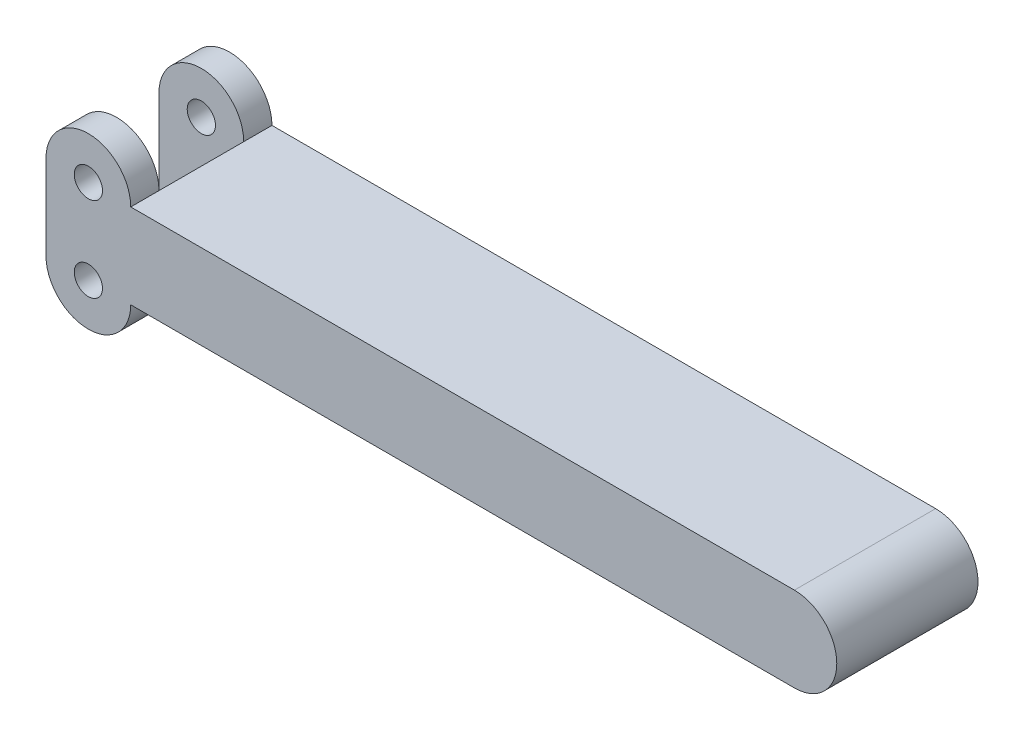
ISO-10303-21;
HEADER;
FILE_DESCRIPTION(('STEP AP214'),'2;1');
FILE_NAME('part.step','',(''),(''),'','','');
FILE_SCHEMA(('AUTOMOTIVE_DESIGN { 1 0 10303 214 1 1 1 1 }'));
ENDSEC;
DATA;
#1=APPLICATION_CONTEXT('core data for automotive mechanical design processes');
#2=APPLICATION_PROTOCOL_DEFINITION('international standard','automotive_design',2000,#1);
#3=PRODUCT_CONTEXT('',#1,'mechanical');
#4=PRODUCT('Part','Part','',(#3));
#5=PRODUCT_RELATED_PRODUCT_CATEGORY('part','',(#4));
#6=PRODUCT_DEFINITION_FORMATION('','',#4);
#7=PRODUCT_DEFINITION_CONTEXT('part definition',#1,'design');
#8=PRODUCT_DEFINITION('design','',#6,#7);
#9=PRODUCT_DEFINITION_SHAPE('','',#8);
#10=(LENGTH_UNIT() NAMED_UNIT(*) SI_UNIT(.MILLI.,.METRE.));
#11=(NAMED_UNIT(*) PLANE_ANGLE_UNIT() SI_UNIT($,.RADIAN.));
#12=(NAMED_UNIT(*) SI_UNIT($,.STERADIAN.) SOLID_ANGLE_UNIT());
#13=UNCERTAINTY_MEASURE_WITH_UNIT(LENGTH_MEASURE(1.E-05),#10,'distance_accuracy_value','');
#14=(GEOMETRIC_REPRESENTATION_CONTEXT(3) GLOBAL_UNCERTAINTY_ASSIGNED_CONTEXT((#13)) GLOBAL_UNIT_ASSIGNED_CONTEXT((#10,
#11,#12)) REPRESENTATION_CONTEXT('',''));
#15=CARTESIAN_POINT('',(0.,0.,0.));
#16=DIRECTION('',(0.,0.,1.));
#17=DIRECTION('',(1.,0.,0.));
#18=AXIS2_PLACEMENT_3D('',#15,#16,#17);
#19=CARTESIAN_POINT('',(0.,19.05,31.75));
#20=DIRECTION('',(0.,0.,-1.));
#21=DIRECTION('',(-1.,0.,0.));
#22=AXIS2_PLACEMENT_3D('',#19,#20,#21);
#23=CYLINDRICAL_SURFACE('',#22,9.525);
#24=CARTESIAN_POINT('',(0.,19.05,25.4));
#25=DIRECTION('',(0.,0.,-1.));
#26=DIRECTION('',(0.,1.,0.));
#27=AXIS2_PLACEMENT_3D('',#24,#25,#26);
#28=CIRCLE('',#27,9.525);
#29=CARTESIAN_POINT('',(-9.525,19.05,25.4));
#30=VERTEX_POINT('',#29);
#31=CARTESIAN_POINT('',(9.525,19.05,25.4));
#32=VERTEX_POINT('',#31);
#33=EDGE_CURVE('E122',#30,#32,#28,.T.);
#34=ORIENTED_EDGE('',*,*,#33,.F.);
#35=DIRECTION('',(0.,0.,-1.));
#36=VECTOR('',#35,1.);
#37=CARTESIAN_POINT('',(-9.525,19.05,31.75));
#38=LINE('',#37,#36);
#39=CARTESIAN_POINT('',(-9.525,19.05,31.75));
#40=VERTEX_POINT('',#39);
#41=EDGE_CURVE('E119',#40,#30,#38,.T.);
#42=ORIENTED_EDGE('',*,*,#41,.F.);
#43=CARTESIAN_POINT('',(0.,19.05,31.75));
#44=DIRECTION('',(0.,0.,1.));
#45=DIRECTION('',(1.,0.,0.));
#46=AXIS2_PLACEMENT_3D('',#43,#44,#45);
#47=CIRCLE('',#46,9.525);
#48=CARTESIAN_POINT('',(9.525,19.05,31.75));
#49=VERTEX_POINT('',#48);
#50=EDGE_CURVE('E106',#49,#40,#47,.T.);
#51=ORIENTED_EDGE('',*,*,#50,.F.);
#52=DIRECTION('',(0.,0.,-1.));
#53=VECTOR('',#52,1.);
#54=CARTESIAN_POINT('',(9.525,19.05,31.75));
#55=LINE('',#54,#53);
#56=EDGE_CURVE('E173',#49,#32,#55,.T.);
#57=ORIENTED_EDGE('',*,*,#56,.T.);
#58=EDGE_LOOP('',(#34,#42,#51,#57));
#59=FACE_BOUND('',#58,.T.);
#60=ADVANCED_FACE('F35',(#59),#23,.T.);
#61=CARTESIAN_POINT('',(0.,19.05,6.35));
#62=DIRECTION('',(0.,0.,-1.));
#63=DIRECTION('',(0.,1.,0.));
#64=AXIS2_PLACEMENT_3D('',#61,#62,#63);
#65=CIRCLE('',#64,9.525);
#66=CARTESIAN_POINT('',(-9.525,19.05,6.35));
#67=VERTEX_POINT('',#66);
#68=CARTESIAN_POINT('',(9.525,19.05,6.35));
#69=VERTEX_POINT('',#68);
#70=EDGE_CURVE('E195',#67,#69,#65,.T.);
#71=ORIENTED_EDGE('',*,*,#70,.T.);
#72=CARTESIAN_POINT('',(9.525,19.05,0.));
#73=VERTEX_POINT('',#72);
#74=EDGE_CURVE('E126',#69,#73,#55,.T.);
#75=ORIENTED_EDGE('',*,*,#74,.T.);
#76=CARTESIAN_POINT('',(0.,19.05,0.));
#77=DIRECTION('',(0.,0.,1.));
#78=DIRECTION('',(1.,0.,0.));
#79=AXIS2_PLACEMENT_3D('',#76,#77,#78);
#80=CIRCLE('',#79,9.525);
#81=CARTESIAN_POINT('',(-9.525,19.05,0.));
#82=VERTEX_POINT('',#81);
#83=EDGE_CURVE('E152',#73,#82,#80,.T.);
#84=ORIENTED_EDGE('',*,*,#83,.T.);
#85=EDGE_CURVE('E127',#67,#82,#38,.T.);
#86=ORIENTED_EDGE('',*,*,#85,.F.);
#87=EDGE_LOOP('',(#71,#75,#84,#86));
#88=FACE_BOUND('',#87,.T.);
#89=ADVANCED_FACE('F236',(#88),#23,.T.);
#90=CARTESIAN_POINT('',(-9.525,0.,31.75));
#91=DIRECTION('',(-1.,0.,0.));
#92=DIRECTION('',(0.,0.,1.));
#93=AXIS2_PLACEMENT_3D('',#90,#91,#92);
#94=PLANE('',#93);
#95=ORIENTED_EDGE('',*,*,#41,.T.);
#96=DIRECTION('',(0.,-1.,0.));
#97=VECTOR('',#96,1.);
#98=CARTESIAN_POINT('',(-9.525,0.,25.4));
#99=LINE('',#98,#97);
#100=CARTESIAN_POINT('',(-9.525,0.,25.4));
#101=VERTEX_POINT('',#100);
#102=EDGE_CURVE('E189',#30,#101,#99,.T.);
#103=ORIENTED_EDGE('',*,*,#102,.T.);
#104=DIRECTION('',(0.,0.,-1.));
#105=VECTOR('',#104,1.);
#106=CARTESIAN_POINT('',(-9.525,0.,31.75));
#107=LINE('',#106,#105);
#108=CARTESIAN_POINT('',(-9.525,0.,31.75));
#109=VERTEX_POINT('',#108);
#110=EDGE_CURVE('E131',#109,#101,#107,.T.);
#111=ORIENTED_EDGE('',*,*,#110,.F.);
#112=DIRECTION('',(0.,1.,0.));
#113=VECTOR('',#112,1.);
#114=CARTESIAN_POINT('',(-9.525,0.,31.75));
#115=LINE('',#114,#113);
#116=EDGE_CURVE('E111',#109,#40,#115,.T.);
#117=ORIENTED_EDGE('',*,*,#116,.T.);
#118=EDGE_LOOP('',(#95,#103,#111,#117));
#119=FACE_BOUND('',#118,.T.);
#120=ADVANCED_FACE('F129',(#119),#94,.T.);
#121=CARTESIAN_POINT('',(0.,19.05,31.75));
#122=DIRECTION('',(0.,0.,-1.));
#123=DIRECTION('',(-1.,0.,0.));
#124=AXIS2_PLACEMENT_3D('',#121,#122,#123);
#125=CYLINDRICAL_SURFACE('',#124,3.175);
#126=CARTESIAN_POINT('',(0.,19.05,31.75));
#127=DIRECTION('',(0.,0.,1.));
#128=DIRECTION('',(1.,0.,0.));
#129=AXIS2_PLACEMENT_3D('',#126,#127,#128);
#130=CIRCLE('',#129,3.175);
#131=CARTESIAN_POINT('',(3.175,19.05,31.75));
#132=VERTEX_POINT('',#131);
#133=EDGE_CURVE('E133',#132,#132,#130,.T.);
#134=ORIENTED_EDGE('',*,*,#133,.T.);
#135=EDGE_LOOP('',(#134));
#136=FACE_BOUND('',#135,.T.);
#137=CARTESIAN_POINT('',(0.,19.05,25.4));
#138=DIRECTION('',(0.,0.,-1.));
#139=DIRECTION('',(0.,1.,0.));
#140=AXIS2_PLACEMENT_3D('',#137,#138,#139);
#141=CIRCLE('',#140,3.175);
#142=CARTESIAN_POINT('',(0.,22.225,25.4));
#143=VERTEX_POINT('',#142);
#144=EDGE_CURVE('E201',#143,#143,#141,.T.);
#145=ORIENTED_EDGE('',*,*,#144,.T.);
#146=EDGE_LOOP('',(#145));
#147=FACE_BOUND('',#146,.T.);
#148=ADVANCED_FACE('F274',(#136,#147),#125,.F.);
#149=CARTESIAN_POINT('',(0.,0.,31.75));
#150=DIRECTION('',(0.,0.,-1.));
#151=DIRECTION('',(-1.,0.,0.));
#152=AXIS2_PLACEMENT_3D('',#149,#150,#151);
#153=CYLINDRICAL_SURFACE('',#152,9.525);
#154=CARTESIAN_POINT('',(0.,0.,25.4));
#155=DIRECTION('',(0.,0.,-1.));
#156=DIRECTION('',(0.,1.,0.));
#157=AXIS2_PLACEMENT_3D('',#154,#155,#156);
#158=CIRCLE('',#157,9.525);
#159=CARTESIAN_POINT('',(9.525,0.,25.4));
#160=VERTEX_POINT('',#159);
#161=EDGE_CURVE('E198',#160,#101,#158,.T.);
#162=ORIENTED_EDGE('',*,*,#161,.F.);
#163=DIRECTION('',(0.,0.,-1.));
#164=VECTOR('',#163,1.);
#165=CARTESIAN_POINT('',(9.525,0.,31.75));
#166=LINE('',#165,#164);
#167=CARTESIAN_POINT('',(9.525,0.,31.75));
#168=VERTEX_POINT('',#167);
#169=EDGE_CURVE('E167',#168,#160,#166,.T.);
#170=ORIENTED_EDGE('',*,*,#169,.F.);
#171=CARTESIAN_POINT('',(0.,0.,31.75));
#172=DIRECTION('',(0.,0.,1.));
#173=DIRECTION('',(1.,0.,0.));
#174=AXIS2_PLACEMENT_3D('',#171,#172,#173);
#175=CIRCLE('',#174,9.525);
#176=EDGE_CURVE('E61',#109,#168,#175,.T.);
#177=ORIENTED_EDGE('',*,*,#176,.F.);
#178=ORIENTED_EDGE('',*,*,#110,.T.);
#179=EDGE_LOOP('',(#162,#170,#177,#178));
#180=FACE_BOUND('',#179,.T.);
#181=ADVANCED_FACE('F249',(#180),#153,.T.);
#182=CARTESIAN_POINT('',(0.,0.,31.75));
#183=DIRECTION('',(0.,0.,-1.));
#184=DIRECTION('',(-1.,0.,0.));
#185=AXIS2_PLACEMENT_3D('',#182,#183,#184);
#186=CYLINDRICAL_SURFACE('',#185,3.175);
#187=CARTESIAN_POINT('',(0.,0.,31.75));
#188=DIRECTION('',(0.,0.,1.));
#189=DIRECTION('',(1.,0.,0.));
#190=AXIS2_PLACEMENT_3D('',#187,#188,#189);
#191=CIRCLE('',#190,3.175);
#192=CARTESIAN_POINT('',(3.175,0.,31.75));
#193=VERTEX_POINT('',#192);
#194=EDGE_CURVE('E139',#193,#193,#191,.T.);
#195=ORIENTED_EDGE('',*,*,#194,.T.);
#196=EDGE_LOOP('',(#195));
#197=FACE_BOUND('',#196,.T.);
#198=CARTESIAN_POINT('',(0.,0.,25.4));
#199=DIRECTION('',(0.,0.,-1.));
#200=DIRECTION('',(0.,1.,0.));
#201=AXIS2_PLACEMENT_3D('',#198,#199,#200);
#202=CIRCLE('',#201,3.175);
#203=CARTESIAN_POINT('',(0.,3.175,25.4));
#204=VERTEX_POINT('',#203);
#205=EDGE_CURVE('E39',#204,#204,#202,.T.);
#206=ORIENTED_EDGE('',*,*,#205,.T.);
#207=EDGE_LOOP('',(#206));
#208=FACE_BOUND('',#207,.T.);
#209=ADVANCED_FACE('F258',(#197,#208),#186,.F.);
#210=CARTESIAN_POINT('',(0.,0.,31.75));
#211=DIRECTION('',(0.,-1.,0.));
#212=DIRECTION('',(1.,0.,0.));
#213=AXIS2_PLACEMENT_3D('',#210,#211,#212);
#214=PLANE('',#213);
#215=DIRECTION('',(-1.,0.,0.));
#216=VECTOR('',#215,1.);
#217=CARTESIAN_POINT('',(0.,0.,0.));
#218=LINE('',#217,#216);
#219=CARTESIAN_POINT('',(158.75,0.,0.));
#220=VERTEX_POINT('',#219);
#221=CARTESIAN_POINT('',(9.525,0.,0.));
#222=VERTEX_POINT('',#221);
#223=EDGE_CURVE('E142',#220,#222,#218,.T.);
#224=ORIENTED_EDGE('',*,*,#223,.F.);
#225=DIRECTION('',(0.,0.,-1.));
#226=VECTOR('',#225,1.);
#227=CARTESIAN_POINT('',(158.75,0.,31.75));
#228=LINE('',#227,#226);
#229=CARTESIAN_POINT('',(158.75,0.,31.75));
#230=VERTEX_POINT('',#229);
#231=EDGE_CURVE('E11',#230,#220,#228,.T.);
#232=ORIENTED_EDGE('',*,*,#231,.F.);
#233=DIRECTION('',(-1.,0.,0.));
#234=VECTOR('',#233,1.);
#235=CARTESIAN_POINT('',(0.,0.,31.75));
#236=LINE('',#235,#234);
#237=EDGE_CURVE('E166',#230,#168,#236,.T.);
#238=ORIENTED_EDGE('',*,*,#237,.T.);
#239=ORIENTED_EDGE('',*,*,#169,.T.);
#240=CARTESIAN_POINT('',(9.525,0.,6.35));
#241=VERTEX_POINT('',#240);
#242=EDGE_CURVE('E171',#160,#241,#166,.T.);
#243=ORIENTED_EDGE('',*,*,#242,.T.);
#244=EDGE_CURVE('E89',#241,#222,#166,.T.);
#245=ORIENTED_EDGE('',*,*,#244,.T.);
#246=EDGE_LOOP('',(#224,#232,#238,#239,#243,#245));
#247=FACE_BOUND('',#246,.T.);
#248=ADVANCED_FACE('F37',(#247),#214,.T.);
#249=CARTESIAN_POINT('',(158.75,9.525,31.75));
#250=DIRECTION('',(0.,0.,-1.));
#251=DIRECTION('',(-1.,0.,0.));
#252=AXIS2_PLACEMENT_3D('',#249,#250,#251);
#253=CYLINDRICAL_SURFACE('',#252,9.52499999999997);
#254=CARTESIAN_POINT('',(158.75,9.525,0.));
#255=DIRECTION('',(0.,0.,1.));
#256=DIRECTION('',(1.,0.,0.));
#257=AXIS2_PLACEMENT_3D('',#254,#255,#256);
#258=CIRCLE('',#257,9.52499999999997);
#259=CARTESIAN_POINT('',(158.75,19.05,0.));
#260=VERTEX_POINT('',#259);
#261=EDGE_CURVE('E145',#220,#260,#258,.T.);
#262=ORIENTED_EDGE('',*,*,#261,.T.);
#263=DIRECTION('',(0.,0.,-1.));
#264=VECTOR('',#263,1.);
#265=CARTESIAN_POINT('',(158.75,19.05,31.75));
#266=LINE('',#265,#264);
#267=CARTESIAN_POINT('',(158.75,19.05,31.75));
#268=VERTEX_POINT('',#267);
#269=EDGE_CURVE('E44',#268,#260,#266,.T.);
#270=ORIENTED_EDGE('',*,*,#269,.F.);
#271=CARTESIAN_POINT('',(158.75,9.525,31.75));
#272=DIRECTION('',(0.,0.,1.));
#273=DIRECTION('',(1.,0.,0.));
#274=AXIS2_PLACEMENT_3D('',#271,#272,#273);
#275=CIRCLE('',#274,9.52499999999997);
#276=EDGE_CURVE('E207',#230,#268,#275,.T.);
#277=ORIENTED_EDGE('',*,*,#276,.F.);
#278=ORIENTED_EDGE('',*,*,#231,.T.);
#279=EDGE_LOOP('',(#262,#270,#277,#278));
#280=FACE_BOUND('',#279,.T.);
#281=ADVANCED_FACE('F251',(#280),#253,.T.);
#282=CARTESIAN_POINT('',(0.,19.05,31.75));
#283=DIRECTION('',(0.,1.,0.));
#284=DIRECTION('',(-1.,0.,0.));
#285=AXIS2_PLACEMENT_3D('',#282,#283,#284);
#286=PLANE('',#285);
#287=DIRECTION('',(1.,0.,0.));
#288=VECTOR('',#287,1.);
#289=CARTESIAN_POINT('',(0.,19.05,0.));
#290=LINE('',#289,#288);
#291=EDGE_CURVE('E149',#73,#260,#290,.T.);
#292=ORIENTED_EDGE('',*,*,#291,.F.);
#293=ORIENTED_EDGE('',*,*,#74,.F.);
#294=DIRECTION('',(0.,0.,-1.));
#295=VECTOR('',#294,1.);
#296=CARTESIAN_POINT('',(9.525,19.05,31.75));
#297=LINE('',#296,#295);
#298=EDGE_CURVE('E146',#32,#69,#297,.T.);
#299=ORIENTED_EDGE('',*,*,#298,.F.);
#300=ORIENTED_EDGE('',*,*,#56,.F.);
#301=DIRECTION('',(1.,0.,0.));
#302=VECTOR('',#301,1.);
#303=CARTESIAN_POINT('',(0.,19.05,31.75));
#304=LINE('',#303,#302);
#305=EDGE_CURVE('E113',#49,#268,#304,.T.);
#306=ORIENTED_EDGE('',*,*,#305,.T.);
#307=ORIENTED_EDGE('',*,*,#269,.T.);
#308=EDGE_LOOP('',(#292,#293,#299,#300,#306,#307));
#309=FACE_BOUND('',#308,.T.);
#310=ADVANCED_FACE('F210',(#309),#286,.T.);
#311=DIRECTION('',(0.,-1.,0.));
#312=VECTOR('',#311,1.);
#313=CARTESIAN_POINT('',(-9.525,0.,6.35));
#314=LINE('',#313,#312);
#315=CARTESIAN_POINT('',(-9.525,0.,6.35));
#316=VERTEX_POINT('',#315);
#317=EDGE_CURVE('E186',#67,#316,#314,.T.);
#318=ORIENTED_EDGE('',*,*,#317,.F.);
#319=ORIENTED_EDGE('',*,*,#85,.T.);
#320=DIRECTION('',(0.,1.,0.));
#321=VECTOR('',#320,1.);
#322=CARTESIAN_POINT('',(-9.525,0.,0.));
#323=LINE('',#322,#321);
#324=CARTESIAN_POINT('',(-9.525,0.,0.));
#325=VERTEX_POINT('',#324);
#326=EDGE_CURVE('E155',#325,#82,#323,.T.);
#327=ORIENTED_EDGE('',*,*,#326,.F.);
#328=EDGE_CURVE('E170',#316,#325,#107,.T.);
#329=ORIENTED_EDGE('',*,*,#328,.F.);
#330=EDGE_LOOP('',(#318,#319,#327,#329));
#331=FACE_BOUND('',#330,.T.);
#332=ADVANCED_FACE('F234',(#331),#94,.T.);
#333=CARTESIAN_POINT('',(0.,19.05,6.35));
#334=DIRECTION('',(0.,0.,-1.));
#335=DIRECTION('',(0.,1.,0.));
#336=AXIS2_PLACEMENT_3D('',#333,#334,#335);
#337=CIRCLE('',#336,3.175);
#338=CARTESIAN_POINT('',(0.,22.225,6.35));
#339=VERTEX_POINT('',#338);
#340=EDGE_CURVE('E181',#339,#339,#337,.T.);
#341=ORIENTED_EDGE('',*,*,#340,.F.);
#342=EDGE_LOOP('',(#341));
#343=FACE_BOUND('',#342,.T.);
#344=CARTESIAN_POINT('',(0.,19.05,0.));
#345=DIRECTION('',(0.,0.,1.));
#346=DIRECTION('',(1.,0.,0.));
#347=AXIS2_PLACEMENT_3D('',#344,#345,#346);
#348=CIRCLE('',#347,3.175);
#349=CARTESIAN_POINT('',(3.175,19.05,0.));
#350=VERTEX_POINT('',#349);
#351=EDGE_CURVE('E160',#350,#350,#348,.T.);
#352=ORIENTED_EDGE('',*,*,#351,.F.);
#353=EDGE_LOOP('',(#352));
#354=FACE_BOUND('',#353,.T.);
#355=ADVANCED_FACE('F267',(#343,#354),#125,.F.);
#356=ORIENTED_EDGE('',*,*,#244,.F.);
#357=CARTESIAN_POINT('',(0.,0.,6.35));
#358=DIRECTION('',(0.,0.,-1.));
#359=DIRECTION('',(0.,1.,0.));
#360=AXIS2_PLACEMENT_3D('',#357,#358,#359);
#361=CIRCLE('',#360,9.525);
#362=EDGE_CURVE('E177',#241,#316,#361,.T.);
#363=ORIENTED_EDGE('',*,*,#362,.T.);
#364=ORIENTED_EDGE('',*,*,#328,.T.);
#365=CARTESIAN_POINT('',(0.,0.,0.));
#366=DIRECTION('',(0.,0.,1.));
#367=DIRECTION('',(1.,0.,0.));
#368=AXIS2_PLACEMENT_3D('',#365,#366,#367);
#369=CIRCLE('',#368,9.525);
#370=EDGE_CURVE('E158',#325,#222,#369,.T.);
#371=ORIENTED_EDGE('',*,*,#370,.T.);
#372=EDGE_LOOP('',(#356,#363,#364,#371));
#373=FACE_BOUND('',#372,.T.);
#374=ADVANCED_FACE('F244',(#373),#153,.T.);
#375=CARTESIAN_POINT('',(0.,0.,6.35));
#376=DIRECTION('',(0.,0.,-1.));
#377=DIRECTION('',(0.,1.,0.));
#378=AXIS2_PLACEMENT_3D('',#375,#376,#377);
#379=CIRCLE('',#378,3.175);
#380=CARTESIAN_POINT('',(0.,3.175,6.35));
#381=VERTEX_POINT('',#380);
#382=EDGE_CURVE('E175',#381,#381,#379,.T.);
#383=ORIENTED_EDGE('',*,*,#382,.F.);
#384=EDGE_LOOP('',(#383));
#385=FACE_BOUND('',#384,.T.);
#386=CARTESIAN_POINT('',(0.,0.,0.));
#387=DIRECTION('',(0.,0.,1.));
#388=DIRECTION('',(1.,0.,0.));
#389=AXIS2_PLACEMENT_3D('',#386,#387,#388);
#390=CIRCLE('',#389,3.175);
#391=CARTESIAN_POINT('',(3.175,0.,0.));
#392=VERTEX_POINT('',#391);
#393=EDGE_CURVE('E163',#392,#392,#390,.T.);
#394=ORIENTED_EDGE('',*,*,#393,.F.);
#395=EDGE_LOOP('',(#394));
#396=FACE_BOUND('',#395,.T.);
#397=ADVANCED_FACE('F270',(#385,#396),#186,.F.);
#398=CARTESIAN_POINT('',(0.,0.,31.75));
#399=DIRECTION('',(0.,0.,1.));
#400=DIRECTION('',(1.,0.,0.));
#401=AXIS2_PLACEMENT_3D('',#398,#399,#400);
#402=PLANE('',#401);
#403=ORIENTED_EDGE('',*,*,#237,.F.);
#404=ORIENTED_EDGE('',*,*,#276,.T.);
#405=ORIENTED_EDGE('',*,*,#305,.F.);
#406=ORIENTED_EDGE('',*,*,#50,.T.);
#407=ORIENTED_EDGE('',*,*,#116,.F.);
#408=ORIENTED_EDGE('',*,*,#176,.T.);
#409=EDGE_LOOP('',(#403,#404,#405,#406,#407,#408));
#410=FACE_BOUND('',#409,.T.);
#411=ORIENTED_EDGE('',*,*,#133,.F.);
#412=EDGE_LOOP('',(#411));
#413=FACE_BOUND('',#412,.T.);
#414=ORIENTED_EDGE('',*,*,#194,.F.);
#415=EDGE_LOOP('',(#414));
#416=FACE_BOUND('',#415,.T.);
#417=ADVANCED_FACE('F108',(#410,#413,#416),#402,.T.);
#418=CARTESIAN_POINT('',(0.,0.,0.));
#419=DIRECTION('',(0.,0.,1.));
#420=DIRECTION('',(1.,0.,0.));
#421=AXIS2_PLACEMENT_3D('',#418,#419,#420);
#422=PLANE('',#421);
#423=ORIENTED_EDGE('',*,*,#223,.T.);
#424=ORIENTED_EDGE('',*,*,#370,.F.);
#425=ORIENTED_EDGE('',*,*,#326,.T.);
#426=ORIENTED_EDGE('',*,*,#83,.F.);
#427=ORIENTED_EDGE('',*,*,#291,.T.);
#428=ORIENTED_EDGE('',*,*,#261,.F.);
#429=EDGE_LOOP('',(#423,#424,#425,#426,#427,#428));
#430=FACE_BOUND('',#429,.T.);
#431=ORIENTED_EDGE('',*,*,#351,.T.);
#432=EDGE_LOOP('',(#431));
#433=FACE_BOUND('',#432,.T.);
#434=ORIENTED_EDGE('',*,*,#393,.T.);
#435=EDGE_LOOP('',(#434));
#436=FACE_BOUND('',#435,.T.);
#437=ADVANCED_FACE('F240',(#430,#433,#436),#422,.F.);
#438=CARTESIAN_POINT('',(9.525,0.,0.));
#439=DIRECTION('',(-1.,0.,0.));
#440=DIRECTION('',(0.,0.,1.));
#441=AXIS2_PLACEMENT_3D('',#438,#439,#440);
#442=PLANE('',#441);
#443=ORIENTED_EDGE('',*,*,#298,.T.);
#444=DIRECTION('',(0.,-1.,0.));
#445=VECTOR('',#444,1.);
#446=CARTESIAN_POINT('',(9.525,0.,6.35));
#447=LINE('',#446,#445);
#448=EDGE_CURVE('E52',#69,#241,#447,.T.);
#449=ORIENTED_EDGE('',*,*,#448,.T.);
#450=ORIENTED_EDGE('',*,*,#242,.F.);
#451=DIRECTION('',(0.,-1.,0.));
#452=VECTOR('',#451,1.);
#453=CARTESIAN_POINT('',(9.525,0.,25.4));
#454=LINE('',#453,#452);
#455=EDGE_CURVE('E183',#32,#160,#454,.T.);
#456=ORIENTED_EDGE('',*,*,#455,.F.);
#457=EDGE_LOOP('',(#443,#449,#450,#456));
#458=FACE_BOUND('',#457,.T.);
#459=ADVANCED_FACE('F245',(#458),#442,.T.);
#460=CARTESIAN_POINT('',(9.525,0.,25.4));
#461=DIRECTION('',(0.,0.,-1.));
#462=DIRECTION('',(0.,1.,0.));
#463=AXIS2_PLACEMENT_3D('',#460,#461,#462);
#464=PLANE('',#463);
#465=ORIENTED_EDGE('',*,*,#144,.F.);
#466=EDGE_LOOP('',(#465));
#467=FACE_BOUND('',#466,.T.);
#468=ORIENTED_EDGE('',*,*,#205,.F.);
#469=EDGE_LOOP('',(#468));
#470=FACE_BOUND('',#469,.T.);
#471=ORIENTED_EDGE('',*,*,#33,.T.);
#472=ORIENTED_EDGE('',*,*,#455,.T.);
#473=ORIENTED_EDGE('',*,*,#161,.T.);
#474=ORIENTED_EDGE('',*,*,#102,.F.);
#475=EDGE_LOOP('',(#471,#472,#473,#474));
#476=FACE_BOUND('',#475,.T.);
#477=ADVANCED_FACE('F247',(#467,#470,#476),#464,.T.);
#478=CARTESIAN_POINT('',(9.525,0.,6.35));
#479=DIRECTION('',(0.,0.,-1.));
#480=DIRECTION('',(0.,1.,0.));
#481=AXIS2_PLACEMENT_3D('',#478,#479,#480);
#482=PLANE('',#481);
#483=ORIENTED_EDGE('',*,*,#340,.T.);
#484=EDGE_LOOP('',(#483));
#485=FACE_BOUND('',#484,.T.);
#486=ORIENTED_EDGE('',*,*,#382,.T.);
#487=EDGE_LOOP('',(#486));
#488=FACE_BOUND('',#487,.T.);
#489=ORIENTED_EDGE('',*,*,#70,.F.);
#490=ORIENTED_EDGE('',*,*,#317,.T.);
#491=ORIENTED_EDGE('',*,*,#362,.F.);
#492=ORIENTED_EDGE('',*,*,#448,.F.);
#493=EDGE_LOOP('',(#489,#490,#491,#492));
#494=FACE_BOUND('',#493,.T.);
#495=ADVANCED_FACE('F229',(#485,#488,#494),#482,.F.);
#496=CLOSED_SHELL('',(#60,#89,#120,#148,#181,#209,#248,#281,#310,#332,#355,#374,#397,#417,#437,
#459,#477,#495));
#497=MANIFOLD_SOLID_BREP('B2',#496);
#498=ADVANCED_BREP_SHAPE_REPRESENTATION('',(#18,#497),#14);
#499=SHAPE_DEFINITION_REPRESENTATION(#9,#498);
ENDSEC;
END-ISO-10303-21;
